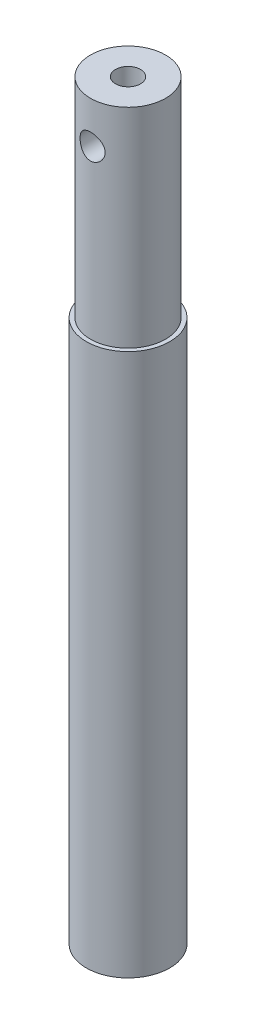
ISO-10303-21;
HEADER;
FILE_DESCRIPTION(('STEP AP214'),'2;1');
FILE_NAME('part.step','',(''),(''),'','','');
FILE_SCHEMA(('AUTOMOTIVE_DESIGN { 1 0 10303 214 1 1 1 1 }'));
ENDSEC;
DATA;
#1=APPLICATION_CONTEXT('core data for automotive mechanical design processes');
#2=APPLICATION_PROTOCOL_DEFINITION('international standard','automotive_design',2000,#1);
#3=PRODUCT_CONTEXT('',#1,'mechanical');
#4=PRODUCT('Part','Part','',(#3));
#5=PRODUCT_RELATED_PRODUCT_CATEGORY('part','',(#4));
#6=PRODUCT_DEFINITION_FORMATION('','',#4);
#7=PRODUCT_DEFINITION_CONTEXT('part definition',#1,'design');
#8=PRODUCT_DEFINITION('design','',#6,#7);
#9=PRODUCT_DEFINITION_SHAPE('','',#8);
#10=(LENGTH_UNIT() NAMED_UNIT(*) SI_UNIT(.MILLI.,.METRE.));
#11=(NAMED_UNIT(*) PLANE_ANGLE_UNIT() SI_UNIT($,.RADIAN.));
#12=(NAMED_UNIT(*) SI_UNIT($,.STERADIAN.) SOLID_ANGLE_UNIT());
#13=UNCERTAINTY_MEASURE_WITH_UNIT(LENGTH_MEASURE(1.E-05),#10,'distance_accuracy_value','');
#14=(GEOMETRIC_REPRESENTATION_CONTEXT(3) GLOBAL_UNCERTAINTY_ASSIGNED_CONTEXT((#13)) GLOBAL_UNIT_ASSIGNED_CONTEXT((#10,
#11,#12)) REPRESENTATION_CONTEXT('',''));
#15=CARTESIAN_POINT('',(0.,0.,0.));
#16=DIRECTION('',(0.,0.,1.));
#17=DIRECTION('',(1.,0.,0.));
#18=AXIS2_PLACEMENT_3D('',#15,#16,#17);
#19=CARTESIAN_POINT('',(0.,90.,0.));
#20=DIRECTION('',(0.,-1.,0.));
#21=DIRECTION('',(0.,0.,1.));
#22=AXIS2_PLACEMENT_3D('',#19,#20,#21);
#23=CYLINDRICAL_SURFACE('',#22,1.5);
#24=CARTESIAN_POINT('',(0.,85.,0.));
#25=DIRECTION('',(0.,0.707106781186547,0.707106781186547));
#26=DIRECTION('',(0.,-0.707106781186547,0.707106781186547));
#27=AXIS2_PLACEMENT_3D('',#24,#25,#26);
#28=ELLIPSE('',#27,2.12132034355964,1.5);
#29=CARTESIAN_POINT('',(-1.5,85.,0.));
#30=VERTEX_POINT('',#29);
#31=CARTESIAN_POINT('',(1.5,85.,0.));
#32=VERTEX_POINT('',#31);
#33=EDGE_CURVE('E11',#30,#32,#28,.F.);
#34=ORIENTED_EDGE('',*,*,#33,.T.);
#35=CARTESIAN_POINT('',(0.,85.,0.));
#36=DIRECTION('',(0.,0.707106781186547,-0.707106781186547));
#37=DIRECTION('',(0.,-0.707106781186547,-0.707106781186547));
#38=AXIS2_PLACEMENT_3D('',#35,#36,#37);
#39=ELLIPSE('',#38,2.12132034355964,1.5);
#40=EDGE_CURVE('E58',#32,#30,#39,.F.);
#41=ORIENTED_EDGE('',*,*,#40,.T.);
#42=EDGE_LOOP('',(#34,#41));
#43=FACE_BOUND('',#42,.T.);
#44=CARTESIAN_POINT('',(0.,90.,0.));
#45=DIRECTION('',(0.,-1.,0.));
#46=DIRECTION('',(0.,0.,-1.));
#47=AXIS2_PLACEMENT_3D('',#44,#45,#46);
#48=CIRCLE('',#47,1.5);
#49=CARTESIAN_POINT('',(0.,90.,-1.5));
#50=VERTEX_POINT('',#49);
#51=EDGE_CURVE('E194',#50,#50,#48,.T.);
#52=ORIENTED_EDGE('',*,*,#51,.F.);
#53=EDGE_LOOP('',(#52));
#54=FACE_BOUND('',#53,.T.);
#55=ADVANCED_FACE('F37',(#43,#54),#23,.F.);
#56=CARTESIAN_POINT('',(0.,65.,0.));
#57=DIRECTION('',(0.,1.,0.));
#58=DIRECTION('',(0.,0.,-1.));
#59=AXIS2_PLACEMENT_3D('',#56,#57,#58);
#60=PLANE('',#59);
#61=CARTESIAN_POINT('',(0.,65.,0.));
#62=DIRECTION('',(0.,-1.,0.));
#63=DIRECTION('',(0.,0.,-1.));
#64=AXIS2_PLACEMENT_3D('',#61,#62,#63);
#65=CIRCLE('',#64,4.5);
#66=CARTESIAN_POINT('',(0.,65.,-4.5));
#67=VERTEX_POINT('',#66);
#68=EDGE_CURVE('E66',#67,#67,#65,.T.);
#69=ORIENTED_EDGE('',*,*,#68,.T.);
#70=EDGE_LOOP('',(#69));
#71=FACE_BOUND('',#70,.T.);
#72=CARTESIAN_POINT('',(0.,65.,0.));
#73=DIRECTION('',(0.,-1.,0.));
#74=DIRECTION('',(0.,0.,-1.));
#75=AXIS2_PLACEMENT_3D('',#72,#73,#74);
#76=CIRCLE('',#75,5.);
#77=CARTESIAN_POINT('',(0.,65.,-5.));
#78=VERTEX_POINT('',#77);
#79=EDGE_CURVE('E202',#78,#78,#76,.T.);
#80=ORIENTED_EDGE('',*,*,#79,.F.);
#81=EDGE_LOOP('',(#80));
#82=FACE_BOUND('',#81,.T.);
#83=ADVANCED_FACE('F105',(#71,#82),#60,.T.);
#84=CARTESIAN_POINT('',(0.,0.,0.));
#85=DIRECTION('',(0.,1.,0.));
#86=DIRECTION('',(0.,0.,-1.));
#87=AXIS2_PLACEMENT_3D('',#84,#85,#86);
#88=PLANE('',#87);
#89=CARTESIAN_POINT('',(0.,0.,0.));
#90=DIRECTION('',(0.,-1.,0.));
#91=DIRECTION('',(0.,0.,-1.));
#92=AXIS2_PLACEMENT_3D('',#89,#90,#91);
#93=CIRCLE('',#92,5.);
#94=CARTESIAN_POINT('',(0.,0.,-5.));
#95=VERTEX_POINT('',#94);
#96=EDGE_CURVE('E208',#95,#95,#93,.T.);
#97=ORIENTED_EDGE('',*,*,#96,.T.);
#98=EDGE_LOOP('',(#97));
#99=FACE_BOUND('',#98,.T.);
#100=CARTESIAN_POINT('',(0.,0.,0.));
#101=DIRECTION('',(0.,-1.,0.));
#102=DIRECTION('',(0.,0.,-1.));
#103=AXIS2_PLACEMENT_3D('',#100,#101,#102);
#104=CIRCLE('',#103,2.5);
#105=CARTESIAN_POINT('',(0.,0.,-2.5));
#106=VERTEX_POINT('',#105);
#107=EDGE_CURVE('E205',#106,#106,#104,.T.);
#108=ORIENTED_EDGE('',*,*,#107,.F.);
#109=EDGE_LOOP('',(#108));
#110=FACE_BOUND('',#109,.T.);
#111=ADVANCED_FACE('F107',(#99,#110),#88,.F.);
#112=CARTESIAN_POINT('',(0.,65.,0.));
#113=DIRECTION('',(0.,-1.,0.));
#114=DIRECTION('',(0.,0.,1.));
#115=AXIS2_PLACEMENT_3D('',#112,#113,#114);
#116=CYLINDRICAL_SURFACE('',#115,5.);
#117=ORIENTED_EDGE('',*,*,#79,.T.);
#118=EDGE_LOOP('',(#117));
#119=FACE_BOUND('',#118,.T.);
#120=ORIENTED_EDGE('',*,*,#96,.F.);
#121=EDGE_LOOP('',(#120));
#122=FACE_BOUND('',#121,.T.);
#123=ADVANCED_FACE('F39',(#119,#122),#116,.T.);
#124=CARTESIAN_POINT('',(0.,65.,0.));
#125=DIRECTION('',(0.,-1.,0.));
#126=DIRECTION('',(0.,0.,1.));
#127=AXIS2_PLACEMENT_3D('',#124,#125,#126);
#128=CYLINDRICAL_SURFACE('',#127,2.5);
#129=CARTESIAN_POINT('',(0.,65.,0.));
#130=DIRECTION('',(0.,-1.,0.));
#131=DIRECTION('',(0.,0.,-1.));
#132=AXIS2_PLACEMENT_3D('',#129,#130,#131);
#133=CIRCLE('',#132,2.5);
#134=CARTESIAN_POINT('',(0.,65.,-2.5));
#135=VERTEX_POINT('',#134);
#136=EDGE_CURVE('E195',#135,#135,#133,.T.);
#137=ORIENTED_EDGE('',*,*,#136,.F.);
#138=EDGE_LOOP('',(#137));
#139=FACE_BOUND('',#138,.T.);
#140=ORIENTED_EDGE('',*,*,#107,.T.);
#141=EDGE_LOOP('',(#140));
#142=FACE_BOUND('',#141,.T.);
#143=ADVANCED_FACE('F99',(#139,#142),#128,.F.);
#144=CARTESIAN_POINT('',(0.,90.,0.));
#145=DIRECTION('',(0.,1.,0.));
#146=DIRECTION('',(0.,0.,-1.));
#147=AXIS2_PLACEMENT_3D('',#144,#145,#146);
#148=PLANE('',#147);
#149=CARTESIAN_POINT('',(0.,90.,0.));
#150=DIRECTION('',(0.,-1.,0.));
#151=DIRECTION('',(0.,0.,-1.));
#152=AXIS2_PLACEMENT_3D('',#149,#150,#151);
#153=CIRCLE('',#152,4.5);
#154=CARTESIAN_POINT('',(0.,90.,-4.5));
#155=VERTEX_POINT('',#154);
#156=EDGE_CURVE('E191',#155,#155,#153,.T.);
#157=ORIENTED_EDGE('',*,*,#156,.F.);
#158=EDGE_LOOP('',(#157));
#159=FACE_BOUND('',#158,.T.);
#160=ORIENTED_EDGE('',*,*,#51,.T.);
#161=EDGE_LOOP('',(#160));
#162=FACE_BOUND('',#161,.T.);
#163=ADVANCED_FACE('F103',(#159,#162),#148,.T.);
#164=CARTESIAN_POINT('',(0.,65.,0.));
#165=DIRECTION('',(0.,1.,0.));
#166=DIRECTION('',(0.,0.,-1.));
#167=AXIS2_PLACEMENT_3D('',#164,#165,#166);
#168=PLANE('',#167);
#169=ORIENTED_EDGE('',*,*,#136,.T.);
#170=EDGE_LOOP('',(#169));
#171=FACE_BOUND('',#170,.T.);
#172=CARTESIAN_POINT('',(0.,65.,0.));
#173=DIRECTION('',(0.,-1.,0.));
#174=DIRECTION('',(0.,0.,-1.));
#175=AXIS2_PLACEMENT_3D('',#172,#173,#174);
#176=CIRCLE('',#175,1.5);
#177=CARTESIAN_POINT('',(0.,65.,-1.5));
#178=VERTEX_POINT('',#177);
#179=EDGE_CURVE('E79',#178,#178,#176,.T.);
#180=ORIENTED_EDGE('',*,*,#179,.F.);
#181=EDGE_LOOP('',(#180));
#182=FACE_BOUND('',#181,.T.);
#183=ADVANCED_FACE('F96',(#171,#182),#168,.F.);
#184=CARTESIAN_POINT('',(0.,90.,0.));
#185=DIRECTION('',(0.,-1.,0.));
#186=DIRECTION('',(0.,0.,1.));
#187=AXIS2_PLACEMENT_3D('',#184,#185,#186);
#188=CYLINDRICAL_SURFACE('',#187,4.5);
#189=CARTESIAN_POINT('',(0.,86.5,4.5));
#190=CARTESIAN_POINT('',(-0.0818450443300849,86.5000003805975,4.50000022951416));
#191=CARTESIAN_POINT('',(-0.163687791807825,86.4932796008092,4.49774654261317));
#192=CARTESIAN_POINT('',(-0.324962641309459,86.4666563367742,4.48897815304921));
#193=CARTESIAN_POINT('',(-0.404394492178228,86.4467524840766,4.48246300803229));
#194=CARTESIAN_POINT('',(-0.558499184252665,86.3945211349239,4.46587961859664));
#195=CARTESIAN_POINT('',(-0.633179738829052,86.3622144063111,4.4558173159628));
#196=CARTESIAN_POINT('',(-0.776062405207986,86.2861882407425,4.43316668576013));
#197=CARTESIAN_POINT('',(-0.844263235438057,86.2424665524961,4.42057786001667));
#198=CARTESIAN_POINT('',(-0.974612512533398,86.1432612927119,4.39371141664508));
#199=CARTESIAN_POINT('',(-1.03650555044746,86.0874531486093,4.37939334695677));
#200=CARTESIAN_POINT('',(-1.15024903905312,85.9663492679402,4.35090472174682));
#201=CARTESIAN_POINT('',(-1.20209727823419,85.9010514476072,4.33673419935824));
#202=CARTESIAN_POINT('',(-1.29573741334179,85.7605223272053,4.30969998715911));
#203=CARTESIAN_POINT('',(-1.33719728733155,85.6850593904018,4.29688558913532));
#204=CARTESIAN_POINT('',(-1.40672831081659,85.5277358583122,4.27462958127902));
#205=CARTESIAN_POINT('',(-1.43480354608015,85.4458772242559,4.26518694241118));
#206=CARTESIAN_POINT('',(-1.47581019226375,85.2809901677549,4.25116954904066));
#207=CARTESIAN_POINT('',(-1.48922017240766,85.1980941872664,4.24644143654417));
#208=CARTESIAN_POINT('',(-1.50201168500172,85.0311043687662,4.24193484944261));
#209=CARTESIAN_POINT('',(-1.50139755240708,84.9470109089362,4.24215484534095));
#210=CARTESIAN_POINT('',(-1.48652985555513,84.784095054334,4.2473852251227));
#211=CARTESIAN_POINT('',(-1.47290086975049,84.7052073956215,4.25217623801299));
#212=CARTESIAN_POINT('',(-1.43340924427413,84.5509098705897,4.26564986586826));
#213=CARTESIAN_POINT('',(-1.40754513988781,84.4755004218474,4.27433294676161));
#214=CARTESIAN_POINT('',(-1.34390858709032,84.3288808756128,4.29476866696873));
#215=CARTESIAN_POINT('',(-1.3059510730609,84.2577579617957,4.30656848689676));
#216=CARTESIAN_POINT('',(-1.21933365945471,84.1226936375804,4.3318883786359));
#217=CARTESIAN_POINT('',(-1.17067066854601,84.0587543095999,4.34540894685695));
#218=CARTESIAN_POINT('',(-1.06102399902335,83.9363626027588,4.37350993751611));
#219=CARTESIAN_POINT('',(-0.999529725114464,83.8783709582364,4.38810884032264));
#220=CARTESIAN_POINT('',(-0.867509354955092,83.7734031000049,4.41610407580555));
#221=CARTESIAN_POINT('',(-0.796982393491218,83.7264279427533,4.42950029307101));
#222=CARTESIAN_POINT('',(-0.6479214195694,83.6444555496474,4.4537566190669));
#223=CARTESIAN_POINT('',(-0.569314914624505,83.6095817629889,4.46459025012059));
#224=CARTESIAN_POINT('',(-0.406903625046763,83.5536952390664,4.48230850716652));
#225=CARTESIAN_POINT('',(-0.323100657232433,83.5326776868648,4.48919450482319));
#226=CARTESIAN_POINT('',(-0.156575744293958,83.5059165009664,4.49801440607161));
#227=CARTESIAN_POINT('',(-0.0739643997972714,83.4995502862409,4.50015002750592));
#228=CARTESIAN_POINT('',(0.091162604940355,83.5004990103977,4.49983354042241));
#229=CARTESIAN_POINT('',(0.173678278979475,83.5078116399698,4.49738220629043));
#230=CARTESIAN_POINT('',(0.333779799456383,83.5354178616039,4.48830037075656));
#231=CARTESIAN_POINT('',(0.411439210252265,83.5553293090742,4.48179298066788));
#232=CARTESIAN_POINT('',(0.56228393786936,83.6070901667001,4.46537770245105));
#233=CARTESIAN_POINT('',(0.635468682762909,83.6389410992017,4.45546938070013));
#234=CARTESIAN_POINT('',(0.777432444589911,83.7146056477612,4.43293396930935));
#235=CARTESIAN_POINT('',(0.846044938825723,83.7587118899247,4.42024222133679));
#236=CARTESIAN_POINT('',(0.975097245203384,83.8572912250202,4.39357880874393));
#237=CARTESIAN_POINT('',(1.03553455169337,83.9117674840476,4.37960675390741));
#238=CARTESIAN_POINT('',(1.14937876170945,84.0324681265099,4.35115271970667));
#239=CARTESIAN_POINT('',(1.20234145386866,84.0991138403903,4.33667641631142));
#240=CARTESIAN_POINT('',(1.29638628348537,84.2406573517163,4.30949959942063));
#241=CARTESIAN_POINT('',(1.33746832189652,84.3155552179511,4.29679910073003));
#242=CARTESIAN_POINT('',(1.40639539562454,84.4715095229348,4.27473587687075));
#243=CARTESIAN_POINT('',(1.43426719824753,84.5525531187531,4.26536641189468));
#244=CARTESIAN_POINT('',(1.47584200013904,84.7185679750662,4.25116248459674));
#245=CARTESIAN_POINT('',(1.48955138243091,84.8035374481065,4.24632597935459));
#246=CARTESIAN_POINT('',(1.50191442371601,84.9702956440614,4.24196788311266));
#247=CARTESIAN_POINT('',(1.5013053859626,85.0520235104302,4.24218600386123));
#248=CARTESIAN_POINT('',(1.48686344017304,85.2141476123831,4.24726904735801));
#249=CARTESIAN_POINT('',(1.47303131918788,85.2945439269326,4.25213369354042));
#250=CARTESIAN_POINT('',(1.43305771969401,85.4502034945037,4.26576786457338));
#251=CARTESIAN_POINT('',(1.40715501902327,85.5255352375067,4.27446147033716));
#252=CARTESIAN_POINT('',(1.34396904863962,85.6708411104074,4.29474598227703));
#253=CARTESIAN_POINT('',(1.30668325283071,85.740814046782,4.3063375314509));
#254=CARTESIAN_POINT('',(1.21989103887514,85.8767255048844,4.33174243839069));
#255=CARTESIAN_POINT('',(1.16992236414687,85.9423547528476,4.34563067463206));
#256=CARTESIAN_POINT('',(1.05996432470347,86.0645347200763,4.37375034424879));
#257=CARTESIAN_POINT('',(0.999972126677225,86.1210828635321,4.38798187368558));
#258=CARTESIAN_POINT('',(0.868862335381034,86.2257166184338,4.41585045788316));
#259=CARTESIAN_POINT('',(0.797402270249593,86.2733865216265,4.42944272701885));
#260=CARTESIAN_POINT('',(0.647036036109934,86.355985643276,4.45388986758918));
#261=CARTESIAN_POINT('',(0.56813177719852,86.3909181188831,4.46474543861895));
#262=CARTESIAN_POINT('',(0.408740470801462,86.445582448733,4.48208272602813));
#263=CARTESIAN_POINT('',(0.328481636514612,86.4659236993951,4.48873818633784));
#264=CARTESIAN_POINT('',(0.165480624015371,86.4931304210157,4.49769610596333));
#265=CARTESIAN_POINT('',(0.0827391383531197,86.4999996152448,4.49999976797857));
#266=CARTESIAN_POINT('',(0.,86.5,4.5));
#267=B_SPLINE_CURVE_WITH_KNOTS('',3,(#189,#190,#191,#192,#193,#194,#195,#196,#197,#198,#199,
#200,#201,#202,#203,#204,#205,#206,#207,#208,#209,#210,#211,#212,#213,#214,#215,#216,#217,#218,
#219,#220,#221,#222,#223,#224,#225,#226,#227,#228,#229,#230,#231,#232,#233,#234,#235,#236,#237,
#238,#239,#240,#241,#242,#243,#244,#245,#246,#247,#248,#249,#250,#251,#252,#253,#254,#255,#256,
#257,#258,#259,#260,#261,#262,#263,#264,#265,#266),.UNSPECIFIED.,.T.,.F.,(4,2,2,2,2,2,2,2,2,2,2,
2,2,2,2,2,2,2,2,2,2,2,2,2,2,2,2,2,2,2,2,2,2,2,2,2,2,2,4),(0.,0.245230659039017,
0.490486777901282,0.735334009305414,0.980229566698647,1.23277026424133,1.48536649931296,
1.74522577235206,2.0050056703925,2.25602888612762,2.50697450981229,2.74645239826921,
2.98595896283223,3.22932256732696,3.47275653837312,3.72889958717052,3.98506718949928,
4.24377608475536,4.50239503315813,4.74980374762755,4.99717069746265,5.2373723696732,
5.47760467926156,5.72415599765605,5.97078271232838,6.22861534321129,6.48645012352496,
6.74376020740156,7.00095427058762,7.24493499096388,7.48890119027065,7.72823380620628,
7.96761957263968,8.21745100037707,8.46735316685669,8.72699491252652,8.98657021728685,
9.23454837560721,9.4824579905721),.UNSPECIFIED.);
#268=CARTESIAN_POINT('',(0.,86.5,4.5));
#269=VERTEX_POINT('',#268);
#270=EDGE_CURVE('E76',#269,#269,#267,.T.);
#271=ORIENTED_EDGE('',*,*,#270,.F.);
#272=EDGE_LOOP('',(#271));
#273=FACE_BOUND('',#272,.T.);
#274=CARTESIAN_POINT('',(1.5,85.,-4.24264068711928));
#275=CARTESIAN_POINT('',(1.50000038692157,84.9182977377459,-4.24264041795651));
#276=CARTESIAN_POINT('',(1.49330217552829,84.8365978002646,-4.24502653936286));
#277=CARTESIAN_POINT('',(1.46677669753322,84.6756183685086,-4.25426361121882));
#278=CARTESIAN_POINT('',(1.4469472682526,84.5963392751913,-4.26111529713283));
#279=CARTESIAN_POINT('',(1.39493322852736,84.4425596605041,-4.27842305533187));
#280=CARTESIAN_POINT('',(1.36277283210487,84.3680501058359,-4.28887205956982));
#281=CARTESIAN_POINT('',(1.28709244266208,84.2254599271781,-4.31218683015487));
#282=CARTESIAN_POINT('',(1.24356994329028,84.1573807261696,-4.32505312955418));
#283=CARTESIAN_POINT('',(1.14457671966432,84.0269200564925,-4.3523173411121));
#284=CARTESIAN_POINT('',(1.08873651206689,83.9648268569924,-4.36675342266966));
#285=CARTESIAN_POINT('',(0.967481500821601,83.850689798163,-4.39520797201504));
#286=CARTESIAN_POINT('',(0.902065162578571,83.7986475526264,-4.40922637243442));
#287=CARTESIAN_POINT('',(0.761406761947523,83.7047816540056,-4.43570800382698));
#288=CARTESIAN_POINT('',(0.685952866836796,83.6632600440731,-4.44812111552408));
#289=CARTESIAN_POINT('',(0.528646834481221,83.5936126223087,-4.46954380156474));
#290=CARTESIAN_POINT('',(0.44679642853083,83.5654832002346,-4.47855429304502));
#291=CARTESIAN_POINT('',(0.282043226150254,83.5243962180514,-4.4918861314786));
#292=CARTESIAN_POINT('',(0.199276132279462,83.5109448306145,-4.49635972166341));
#293=CARTESIAN_POINT('',(0.0325468122361427,83.498025559959,-4.5006541232737));
#294=CARTESIAN_POINT('',(-0.0514151003158347,83.4985540725214,-4.50047613394335));
#295=CARTESIAN_POINT('',(-0.214655272790723,83.513266381849,-4.49559059428104));
#296=CARTESIAN_POINT('',(-0.293988072887498,83.5269137927118,-4.49106097132703));
#297=CARTESIAN_POINT('',(-0.449165158233238,83.5665894714707,-4.47820451009571));
#298=CARTESIAN_POINT('',(-0.52500920666876,83.5926185784696,-4.46987741446672));
#299=CARTESIAN_POINT('',(-0.672228712263017,83.6566319759592,-4.45013505439938));
#300=CARTESIAN_POINT('',(-0.743532331453492,83.6947689078202,-4.43868063786404));
#301=CARTESIAN_POINT('',(-0.878886488290749,83.7817895581726,-4.41387589557997));
#302=CARTESIAN_POINT('',(-0.94293500157715,83.8306762649899,-4.40052504300777));
#303=CARTESIAN_POINT('',(-1.06515129982786,83.9405115901911,-4.37259287776335));
#304=CARTESIAN_POINT('',(-1.12290023560133,84.0019197367682,-4.35798322759));
#305=CARTESIAN_POINT('',(-1.22741588939384,84.133673088584,-4.32971002867667));
#306=CARTESIAN_POINT('',(-1.27418091490951,84.2040196685698,-4.31604662597175));
#307=CARTESIAN_POINT('',(-1.3559811825641,84.3529804384231,-4.29105787703296));
#308=CARTESIAN_POINT('',(-1.39083969547657,84.4316981970517,-4.27976864008232));
#309=CARTESIAN_POINT('',(-1.44666478994926,84.5943570913994,-4.26122476317448));
#310=CARTESIAN_POINT('',(-1.46763719363329,84.6782960218327,-4.25396843251835));
#311=CARTESIAN_POINT('',(-1.49424192313571,84.8449575331009,-4.24469454453105));
#312=CARTESIAN_POINT('',(-1.50052364325862,84.9275641371186,-4.24245540472709));
#313=CARTESIAN_POINT('',(-1.49940815836741,85.0926642236755,-4.242850080942));
#314=CARTESIAN_POINT('',(-1.49201343784089,85.1751577240371,-4.24548301189152));
#315=CARTESIAN_POINT('',(-1.46433847732775,85.3347354485667,-4.25510427134068));
#316=CARTESIAN_POINT('',(-1.44450959097084,85.4119081452259,-4.2619398816089));
#317=CARTESIAN_POINT('',(-1.3930707938409,85.561815409359,-4.27902830506905));
#318=CARTESIAN_POINT('',(-1.36145879454519,85.6345491873862,-4.2892817240236));
#319=CARTESIAN_POINT('',(-1.28621151110836,85.7760706312704,-4.31245316393576));
#320=CARTESIAN_POINT('',(-1.24222667753774,85.8446599639627,-4.32544538498414));
#321=CARTESIAN_POINT('',(-1.14387844583636,85.9737190785756,-4.35248653096475));
#322=CARTESIAN_POINT('',(-1.08951198824818,86.0341864579918,-4.36653576665699));
#323=CARTESIAN_POINT('',(-0.968837558850483,86.148291976136,-4.39492557956765));
#324=CARTESIAN_POINT('',(-0.902080905819975,86.2014615850283,-4.40924765366843));
#325=CARTESIAN_POINT('',(-0.760240937100387,86.2958742135221,-4.43590277419665));
#326=CARTESIAN_POINT('',(-0.685157917296835,86.3371176567436,-4.44823589126543));
#327=CARTESIAN_POINT('',(-0.529169793648454,86.4061301572926,-4.46946608715904));
#328=CARTESIAN_POINT('',(-0.448306684981804,86.4339869157221,-4.47838545006796));
#329=CARTESIAN_POINT('',(-0.282687698769031,86.4755916130901,-4.49187916256662));
#330=CARTESIAN_POINT('',(-0.19793323793084,86.4893446448207,-4.49645508051028));
#331=CARTESIAN_POINT('',(-0.0312230037900659,86.5018931164085,-4.50062794854384));
#332=CARTESIAN_POINT('',(0.0506770858800229,86.5013611808986,-4.50044880134159));
#333=CARTESIAN_POINT('',(0.213166717500256,86.4870140377804,-4.49568294779097));
#334=CARTESIAN_POINT('',(0.293756365228581,86.4731999077708,-4.49109659900363));
#335=CARTESIAN_POINT('',(0.450063179148085,86.4331266481361,-4.47811372431619));
#336=CARTESIAN_POINT('',(0.525837406369182,86.4070686769706,-4.46977887541723));
#337=CARTESIAN_POINT('',(0.671967526409691,86.3434337033543,-4.45015741056743));
#338=CARTESIAN_POINT('',(0.742322436213646,86.3058546172045,-4.43887026072025));
#339=CARTESIAN_POINT('',(0.878451024463172,86.218645731847,-4.41398803241821));
#340=CARTESIAN_POINT('',(0.943959377336402,86.1686219719275,-4.4003230873789));
#341=CARTESIAN_POINT('',(1.06587153940863,86.0586139132657,-4.37239483187819));
#342=CARTESIAN_POINT('',(1.12227243243688,85.9986264366059,-4.35813133159646));
#343=CARTESIAN_POINT('',(1.22661271324967,85.8675859666196,-4.32994919738397));
#344=CARTESIAN_POINT('',(1.27413444899685,85.796191733535,-4.31606591982946));
#345=CARTESIAN_POINT('',(1.35647151495167,85.6459983596458,-4.29090289984523));
#346=CARTESIAN_POINT('',(1.39129016522921,85.5672011604555,-4.27962247741874));
#347=CARTESIAN_POINT('',(1.44576574230625,85.4080572639765,-4.26152001309772));
#348=CARTESIAN_POINT('',(1.46603686372428,85.3279416047119,-4.25451949285773));
#349=CARTESIAN_POINT('',(1.4931514802239,85.1652159242999,-4.24508075309277));
#350=CARTESIAN_POINT('',(1.49999960879489,85.0826067738839,-4.24264095926191));
#351=CARTESIAN_POINT('',(1.5,85.,-4.24264068711928));
#352=B_SPLINE_CURVE_WITH_KNOTS('',3,(#274,#275,#276,#277,#278,#279,#280,#281,#282,#283,#284,
#285,#286,#287,#288,#289,#290,#291,#292,#293,#294,#295,#296,#297,#298,#299,#300,#301,#302,#303,
#304,#305,#306,#307,#308,#309,#310,#311,#312,#313,#314,#315,#316,#317,#318,#319,#320,#321,#322,
#323,#324,#325,#326,#327,#328,#329,#330,#331,#332,#333,#334,#335,#336,#337,#338,#339,#340,#341,
#342,#343,#344,#345,#346,#347,#348,#349,#350,#351),.UNSPECIFIED.,.T.,.F.,(4,2,2,2,2,2,2,2,2,2,2,
2,2,2,2,2,2,2,2,2,2,2,2,2,2,2,2,2,2,2,2,2,2,2,2,2,2,2,4),(0.,0.244800877199017,
0.489642082522738,0.734004941251242,0.978421749278151,1.23152006141351,1.48465897757981,
1.74440259215485,2.00407614580182,2.25471478147401,2.50528879953491,2.74603507238353,
2.98679766283855,3.23072482290502,3.47471987811033,3.73020261545876,3.98572469418159,
4.24488959763006,4.50394577031476,4.75131437043211,4.99863803752402,5.23746593649715,
5.47633618716969,5.72278286600123,5.96930228489744,6.22768212253191,6.48605278132849,
6.74270686782829,6.99926824502787,7.24377127013005,7.48825446011223,7.72885434057197,
7.96949776141415,8.21903279277501,8.46864756645499,8.72803354100768,8.98735167396851,
9.23494818240589,9.48245920782248),.UNSPECIFIED.);
#353=CARTESIAN_POINT('',(1.5,85.,-4.24264068711928));
#354=VERTEX_POINT('',#353);
#355=EDGE_CURVE('E74',#354,#354,#352,.T.);
#356=ORIENTED_EDGE('',*,*,#355,.F.);
#357=EDGE_LOOP('',(#356));
#358=FACE_BOUND('',#357,.T.);
#359=ORIENTED_EDGE('',*,*,#156,.T.);
#360=EDGE_LOOP('',(#359));
#361=FACE_BOUND('',#360,.T.);
#362=ORIENTED_EDGE('',*,*,#68,.F.);
#363=EDGE_LOOP('',(#362));
#364=FACE_BOUND('',#363,.T.);
#365=ADVANCED_FACE('F91',(#273,#358,#361,#364),#188,.T.);
#366=CARTESIAN_POINT('',(0.,85.,0.));
#367=DIRECTION('',(0.,0.707106781186547,0.707106781186547));
#368=DIRECTION('',(0.,-0.707106781186547,0.707106781186547));
#369=AXIS2_PLACEMENT_3D('',#366,#367,#368);
#370=ELLIPSE('',#369,2.12132034355964,1.5);
#371=EDGE_CURVE('E45',#30,#32,#370,.T.);
#372=ORIENTED_EDGE('',*,*,#371,.T.);
#373=CARTESIAN_POINT('',(0.,85.,0.));
#374=DIRECTION('',(0.,0.707106781186547,-0.707106781186547));
#375=DIRECTION('',(0.,-0.707106781186547,-0.707106781186547));
#376=AXIS2_PLACEMENT_3D('',#373,#374,#375);
#377=ELLIPSE('',#376,2.12132034355964,1.5);
#378=EDGE_CURVE('E51',#32,#30,#377,.T.);
#379=ORIENTED_EDGE('',*,*,#378,.T.);
#380=EDGE_LOOP('',(#372,#379));
#381=FACE_BOUND('',#380,.T.);
#382=ORIENTED_EDGE('',*,*,#179,.T.);
#383=EDGE_LOOP('',(#382));
#384=FACE_BOUND('',#383,.T.);
#385=ADVANCED_FACE('F55',(#381,#384),#23,.F.);
#386=CARTESIAN_POINT('',(0.,85.,32.5));
#387=DIRECTION('',(0.,0.,-1.));
#388=DIRECTION('',(1.,0.,0.));
#389=AXIS2_PLACEMENT_3D('',#386,#387,#388);
#390=CYLINDRICAL_SURFACE('',#389,1.5);
#391=ORIENTED_EDGE('',*,*,#371,.F.);
#392=ORIENTED_EDGE('',*,*,#40,.F.);
#393=EDGE_LOOP('',(#391,#392));
#394=FACE_BOUND('',#393,.T.);
#395=ORIENTED_EDGE('',*,*,#270,.T.);
#396=EDGE_LOOP('',(#395));
#397=FACE_BOUND('',#396,.T.);
#398=ADVANCED_FACE('F62',(#394,#397),#390,.F.);
#399=ORIENTED_EDGE('',*,*,#33,.F.);
#400=ORIENTED_EDGE('',*,*,#378,.F.);
#401=EDGE_LOOP('',(#399,#400));
#402=FACE_BOUND('',#401,.T.);
#403=ORIENTED_EDGE('',*,*,#355,.T.);
#404=EDGE_LOOP('',(#403));
#405=FACE_BOUND('',#404,.T.);
#406=ADVANCED_FACE('F68',(#402,#405),#390,.F.);
#407=CLOSED_SHELL('',(#55,#83,#111,#123,#143,#163,#183,#365,#385,#398,#406));
#408=MANIFOLD_SOLID_BREP('B2',#407);
#409=ADVANCED_BREP_SHAPE_REPRESENTATION('',(#18,#408),#14);
#410=SHAPE_DEFINITION_REPRESENTATION(#9,#409);
ENDSEC;
END-ISO-10303-21;
